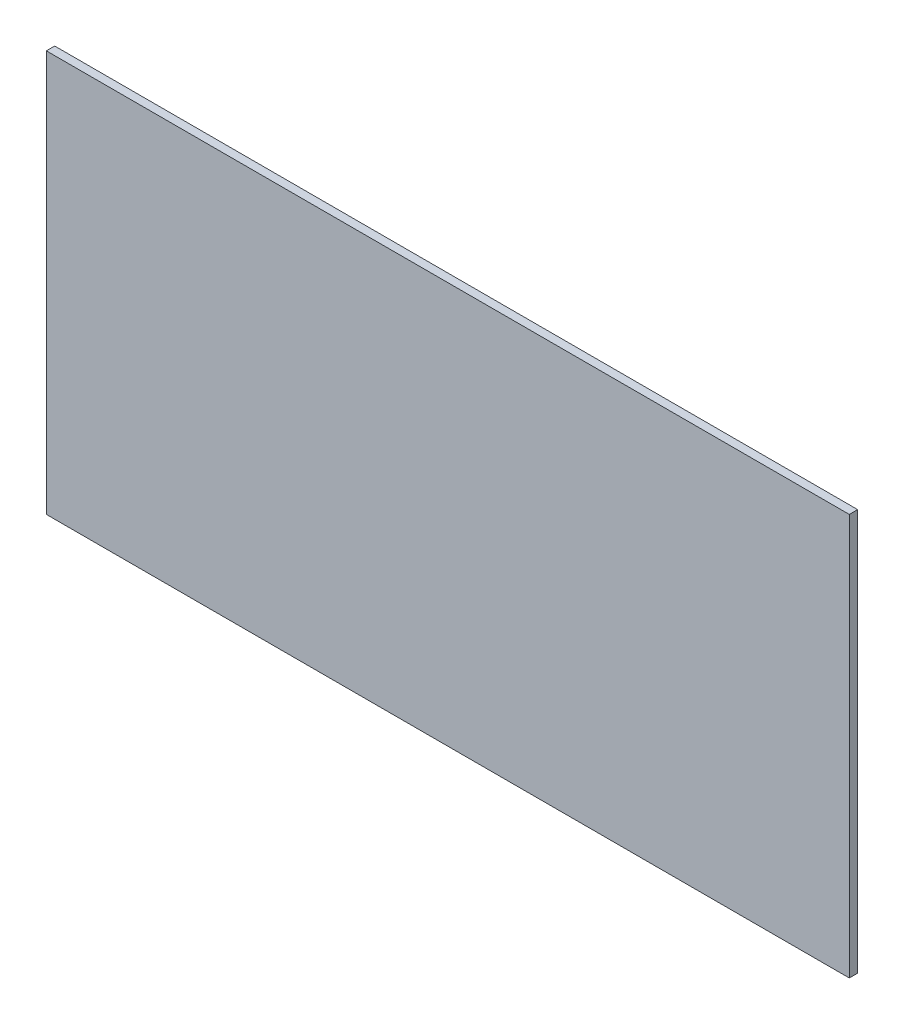
ISO-10303-21;
HEADER;
FILE_DESCRIPTION(('STEP AP214'),'2;1');
FILE_NAME('part.step','',(''),(''),'','','');
FILE_SCHEMA(('AUTOMOTIVE_DESIGN { 1 0 10303 214 1 1 1 1 }'));
ENDSEC;
DATA;
#1=APPLICATION_CONTEXT('core data for automotive mechanical design processes');
#2=APPLICATION_PROTOCOL_DEFINITION('international standard','automotive_design',2000,#1);
#3=PRODUCT_CONTEXT('',#1,'mechanical');
#4=PRODUCT('Part','Part','',(#3));
#5=PRODUCT_RELATED_PRODUCT_CATEGORY('part','',(#4));
#6=PRODUCT_DEFINITION_FORMATION('','',#4);
#7=PRODUCT_DEFINITION_CONTEXT('part definition',#1,'design');
#8=PRODUCT_DEFINITION('design','',#6,#7);
#9=PRODUCT_DEFINITION_SHAPE('','',#8);
#10=(LENGTH_UNIT() NAMED_UNIT(*) SI_UNIT(.MILLI.,.METRE.));
#11=(NAMED_UNIT(*) PLANE_ANGLE_UNIT() SI_UNIT($,.RADIAN.));
#12=(NAMED_UNIT(*) SI_UNIT($,.STERADIAN.) SOLID_ANGLE_UNIT());
#13=UNCERTAINTY_MEASURE_WITH_UNIT(LENGTH_MEASURE(1.E-05),#10,'distance_accuracy_value','');
#14=(GEOMETRIC_REPRESENTATION_CONTEXT(3) GLOBAL_UNCERTAINTY_ASSIGNED_CONTEXT((#13)) GLOBAL_UNIT_ASSIGNED_CONTEXT((#10,
#11,#12)) REPRESENTATION_CONTEXT('',''));
#15=CARTESIAN_POINT('',(0.,0.,0.));
#16=DIRECTION('',(0.,0.,1.));
#17=DIRECTION('',(1.,0.,0.));
#18=AXIS2_PLACEMENT_3D('',#15,#16,#17);
#19=CARTESIAN_POINT('',(0.,0.,25.4));
#20=DIRECTION('',(1.,0.,0.));
#21=DIRECTION('',(0.,1.,0.));
#22=AXIS2_PLACEMENT_3D('',#19,#20,#21);
#23=PLANE('',#22);
#24=DIRECTION('',(0.,-1.,0.));
#25=VECTOR('',#24,1.);
#26=CARTESIAN_POINT('',(0.,0.,0.));
#27=LINE('',#26,#25);
#28=CARTESIAN_POINT('',(0.,0.,0.));
#29=VERTEX_POINT('',#28);
#30=CARTESIAN_POINT('',(1.49308937752045E-13,-1219.2,0.));
#31=VERTEX_POINT('',#30);
#32=EDGE_CURVE('E96',#29,#31,#27,.T.);
#33=ORIENTED_EDGE('',*,*,#32,.T.);
#34=DIRECTION('',(0.,0.,-1.));
#35=VECTOR('',#34,1.);
#36=CARTESIAN_POINT('',(1.49308937752045E-13,-1219.2,25.4));
#37=LINE('',#36,#35);
#38=CARTESIAN_POINT('',(1.49308937752045E-13,-1219.2,25.4));
#39=VERTEX_POINT('',#38);
#40=EDGE_CURVE('E11',#39,#31,#37,.T.);
#41=ORIENTED_EDGE('',*,*,#40,.F.);
#42=DIRECTION('',(0.,-1.,0.));
#43=VECTOR('',#42,1.);
#44=CARTESIAN_POINT('',(0.,0.,25.4));
#45=LINE('',#44,#43);
#46=CARTESIAN_POINT('',(0.,0.,25.4));
#47=VERTEX_POINT('',#46);
#48=EDGE_CURVE('E84',#47,#39,#45,.T.);
#49=ORIENTED_EDGE('',*,*,#48,.F.);
#50=DIRECTION('',(0.,0.,-1.));
#51=VECTOR('',#50,1.);
#52=CARTESIAN_POINT('',(0.,0.,25.4));
#53=LINE('',#52,#51);
#54=EDGE_CURVE('E92',#47,#29,#53,.T.);
#55=ORIENTED_EDGE('',*,*,#54,.T.);
#56=EDGE_LOOP('',(#33,#41,#49,#55));
#57=FACE_BOUND('',#56,.T.);
#58=ADVANCED_FACE('F33',(#57),#23,.F.);
#59=CARTESIAN_POINT('',(1.49308937752045E-13,-1219.2,25.4));
#60=DIRECTION('',(0.,1.,0.));
#61=DIRECTION('',(0.,0.,1.));
#62=AXIS2_PLACEMENT_3D('',#59,#60,#61);
#63=PLANE('',#62);
#64=DIRECTION('',(1.,0.,0.));
#65=VECTOR('',#64,1.);
#66=CARTESIAN_POINT('',(1.49308937752045E-13,-1219.2,0.));
#67=LINE('',#66,#65);
#68=CARTESIAN_POINT('',(2438.4,-1219.2,0.));
#69=VERTEX_POINT('',#68);
#70=EDGE_CURVE('E88',#31,#69,#67,.T.);
#71=ORIENTED_EDGE('',*,*,#70,.T.);
#72=DIRECTION('',(0.,0.,-1.));
#73=VECTOR('',#72,1.);
#74=CARTESIAN_POINT('',(2438.4,-1219.2,25.4));
#75=LINE('',#74,#73);
#76=CARTESIAN_POINT('',(2438.4,-1219.2,25.4));
#77=VERTEX_POINT('',#76);
#78=EDGE_CURVE('E41',#77,#69,#75,.T.);
#79=ORIENTED_EDGE('',*,*,#78,.F.);
#80=DIRECTION('',(1.,0.,0.));
#81=VECTOR('',#80,1.);
#82=CARTESIAN_POINT('',(1.49308937752045E-13,-1219.2,25.4));
#83=LINE('',#82,#81);
#84=EDGE_CURVE('E79',#39,#77,#83,.T.);
#85=ORIENTED_EDGE('',*,*,#84,.F.);
#86=ORIENTED_EDGE('',*,*,#40,.T.);
#87=EDGE_LOOP('',(#71,#79,#85,#86));
#88=FACE_BOUND('',#87,.T.);
#89=ADVANCED_FACE('F87',(#88),#63,.F.);
#90=CARTESIAN_POINT('',(2438.4,0.,25.4));
#91=DIRECTION('',(-1.,0.,0.));
#92=DIRECTION('',(0.,0.,1.));
#93=AXIS2_PLACEMENT_3D('',#90,#91,#92);
#94=PLANE('',#93);
#95=DIRECTION('',(0.,1.,0.));
#96=VECTOR('',#95,1.);
#97=CARTESIAN_POINT('',(2438.4,0.,0.));
#98=LINE('',#97,#96);
#99=CARTESIAN_POINT('',(2438.4,0.,0.));
#100=VERTEX_POINT('',#99);
#101=EDGE_CURVE('E66',#69,#100,#98,.T.);
#102=ORIENTED_EDGE('',*,*,#101,.T.);
#103=DIRECTION('',(0.,0.,-1.));
#104=VECTOR('',#103,1.);
#105=CARTESIAN_POINT('',(2438.4,0.,25.4));
#106=LINE('',#105,#104);
#107=CARTESIAN_POINT('',(2438.4,0.,25.4));
#108=VERTEX_POINT('',#107);
#109=EDGE_CURVE('E89',#108,#100,#106,.T.);
#110=ORIENTED_EDGE('',*,*,#109,.F.);
#111=DIRECTION('',(0.,1.,0.));
#112=VECTOR('',#111,1.);
#113=CARTESIAN_POINT('',(2438.4,0.,25.4));
#114=LINE('',#113,#112);
#115=EDGE_CURVE('E82',#77,#108,#114,.T.);
#116=ORIENTED_EDGE('',*,*,#115,.F.);
#117=ORIENTED_EDGE('',*,*,#78,.T.);
#118=EDGE_LOOP('',(#102,#110,#116,#117));
#119=FACE_BOUND('',#118,.T.);
#120=ADVANCED_FACE('F90',(#119),#94,.F.);
#121=CARTESIAN_POINT('',(0.,0.,25.4));
#122=DIRECTION('',(0.,-1.,0.));
#123=DIRECTION('',(0.,0.,-1.));
#124=AXIS2_PLACEMENT_3D('',#121,#122,#123);
#125=PLANE('',#124);
#126=DIRECTION('',(-1.,0.,0.));
#127=VECTOR('',#126,1.);
#128=CARTESIAN_POINT('',(0.,0.,0.));
#129=LINE('',#128,#127);
#130=EDGE_CURVE('E72',#100,#29,#129,.T.);
#131=ORIENTED_EDGE('',*,*,#130,.T.);
#132=ORIENTED_EDGE('',*,*,#54,.F.);
#133=DIRECTION('',(-1.,0.,0.));
#134=VECTOR('',#133,1.);
#135=CARTESIAN_POINT('',(0.,0.,25.4));
#136=LINE('',#135,#134);
#137=EDGE_CURVE('E49',#108,#47,#136,.T.);
#138=ORIENTED_EDGE('',*,*,#137,.F.);
#139=ORIENTED_EDGE('',*,*,#109,.T.);
#140=EDGE_LOOP('',(#131,#132,#138,#139));
#141=FACE_BOUND('',#140,.T.);
#142=ADVANCED_FACE('F103',(#141),#125,.F.);
#143=CARTESIAN_POINT('',(0.,0.,25.4));
#144=DIRECTION('',(0.,0.,1.));
#145=DIRECTION('',(1.,0.,0.));
#146=AXIS2_PLACEMENT_3D('',#143,#144,#145);
#147=PLANE('',#146);
#148=ORIENTED_EDGE('',*,*,#48,.T.);
#149=ORIENTED_EDGE('',*,*,#84,.T.);
#150=ORIENTED_EDGE('',*,*,#115,.T.);
#151=ORIENTED_EDGE('',*,*,#137,.T.);
#152=EDGE_LOOP('',(#148,#149,#150,#151));
#153=FACE_BOUND('',#152,.T.);
#154=ADVANCED_FACE('F80',(#153),#147,.T.);
#155=CARTESIAN_POINT('',(0.,0.,0.));
#156=DIRECTION('',(0.,0.,1.));
#157=DIRECTION('',(1.,0.,0.));
#158=AXIS2_PLACEMENT_3D('',#155,#156,#157);
#159=PLANE('',#158);
#160=ORIENTED_EDGE('',*,*,#32,.F.);
#161=ORIENTED_EDGE('',*,*,#130,.F.);
#162=ORIENTED_EDGE('',*,*,#101,.F.);
#163=ORIENTED_EDGE('',*,*,#70,.F.);
#164=EDGE_LOOP('',(#160,#161,#162,#163));
#165=FACE_BOUND('',#164,.T.);
#166=ADVANCED_FACE('F106',(#165),#159,.F.);
#167=CLOSED_SHELL('',(#58,#89,#120,#142,#154,#166));
#168=MANIFOLD_SOLID_BREP('B2',#167);
#169=ADVANCED_BREP_SHAPE_REPRESENTATION('',(#18,#168),#14);
#170=SHAPE_DEFINITION_REPRESENTATION(#9,#169);
ENDSEC;
END-ISO-10303-21;
